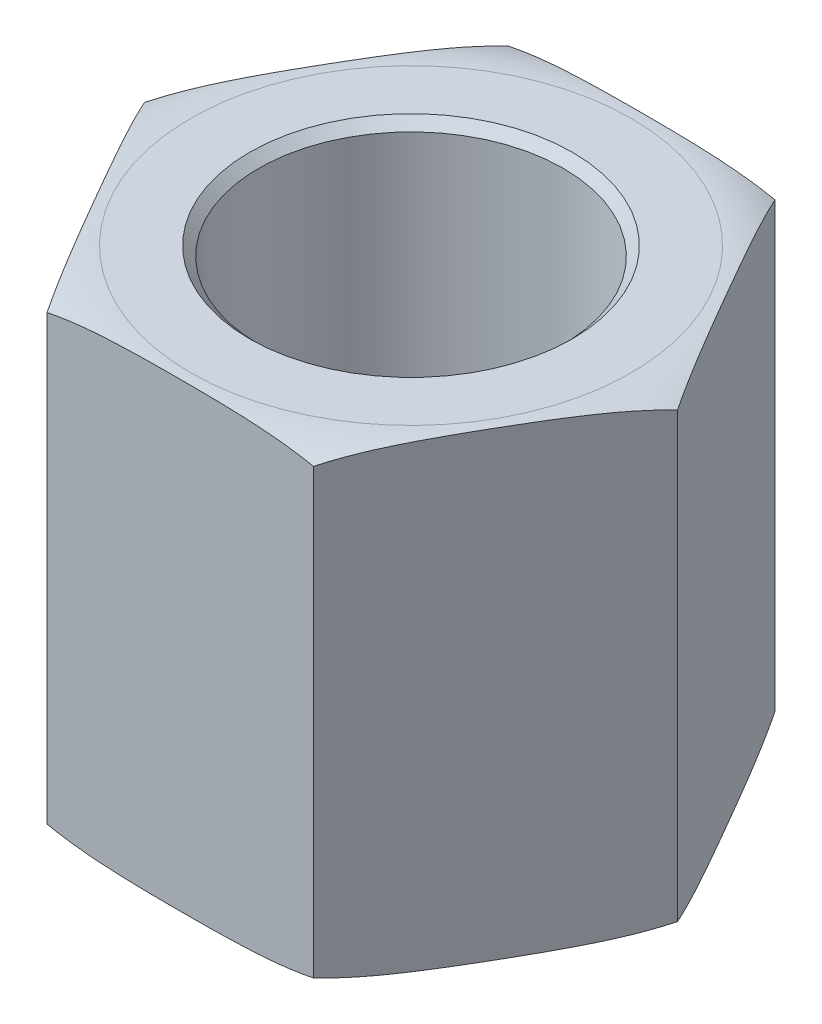
ISO-10303-21;
HEADER;
FILE_DESCRIPTION(('STEP AP214'),'2;1');
FILE_NAME('part.step','',(''),(''),'','','');
FILE_SCHEMA(('AUTOMOTIVE_DESIGN { 1 0 10303 214 1 1 1 1 }'));
ENDSEC;
DATA;
#1=APPLICATION_CONTEXT('core data for automotive mechanical design processes');
#2=APPLICATION_PROTOCOL_DEFINITION('international standard','automotive_design',2000,#1);
#3=PRODUCT_CONTEXT('',#1,'mechanical');
#4=PRODUCT('Part','Part','',(#3));
#5=PRODUCT_RELATED_PRODUCT_CATEGORY('part','',(#4));
#6=PRODUCT_DEFINITION_FORMATION('','',#4);
#7=PRODUCT_DEFINITION_CONTEXT('part definition',#1,'design');
#8=PRODUCT_DEFINITION('design','',#6,#7);
#9=PRODUCT_DEFINITION_SHAPE('','',#8);
#10=(LENGTH_UNIT() NAMED_UNIT(*) SI_UNIT(.MILLI.,.METRE.));
#11=(NAMED_UNIT(*) PLANE_ANGLE_UNIT() SI_UNIT($,.RADIAN.));
#12=(NAMED_UNIT(*) SI_UNIT($,.STERADIAN.) SOLID_ANGLE_UNIT());
#13=UNCERTAINTY_MEASURE_WITH_UNIT(LENGTH_MEASURE(1.E-05),#10,'distance_accuracy_value','');
#14=(GEOMETRIC_REPRESENTATION_CONTEXT(3) GLOBAL_UNCERTAINTY_ASSIGNED_CONTEXT((#13)) GLOBAL_UNIT_ASSIGNED_CONTEXT((#10,
#11,#12)) REPRESENTATION_CONTEXT('',''));
#15=CARTESIAN_POINT('',(0.,0.,0.));
#16=DIRECTION('',(0.,0.,1.));
#17=DIRECTION('',(1.,0.,0.));
#18=AXIS2_PLACEMENT_3D('',#15,#16,#17);
#19=CARTESIAN_POINT('',(3.66617420935412,3.175,0.));
#20=DIRECTION('',(-0.866025403784439,0.,0.5));
#21=DIRECTION('',(0.5,0.,0.866025403784439));
#22=AXIS2_PLACEMENT_3D('',#19,#20,#21);
#23=PLANE('',#22);
#24=DIRECTION('',(0.,1.,0.));
#25=VECTOR('',#24,1.);
#26=CARTESIAN_POINT('',(1.83308710467704,3.175,-3.175));
#27=LINE('',#26,#25);
#28=CARTESIAN_POINT('',(1.83308710467704,-3.048,-3.17500000000001));
#29=VERTEX_POINT('',#28);
#30=CARTESIAN_POINT('',(1.83308710467705,3.048,-3.175));
#31=VERTEX_POINT('',#30);
#32=EDGE_CURVE('E143',#29,#31,#27,.T.);
#33=ORIENTED_EDGE('',*,*,#32,.T.);
#34=CARTESIAN_POINT('',(3.66617420935412,3.048,0.));
#35=CARTESIAN_POINT('',(3.62797961467394,3.06390141489968,-0.0661549785605595));
#36=CARTESIAN_POINT('',(3.58956810864156,3.0774886076105,-0.132685658603879));
#37=CARTESIAN_POINT('',(3.5124905179571,3.10081619794021,-0.266187961794368));
#38=CARTESIAN_POINT('',(3.47382473049846,3.11056047713974,-0.333159070187402));
#39=CARTESIAN_POINT('',(3.39641631867872,3.1269966530451,-0.467234372392399));
#40=CARTESIAN_POINT('',(3.35767399633311,3.13369453286691,-0.534338043098205));
#41=CARTESIAN_POINT('',(3.28009834620112,3.1447767572932,-0.668703010557008));
#42=CARTESIAN_POINT('',(3.24126499587769,3.14916045047396,-0.735964346345298));
#43=CARTESIAN_POINT('',(3.16354065964313,3.15624030042628,-0.870586845688133));
#44=CARTESIAN_POINT('',(3.12464965374474,3.15893552375912,-0.937948043861607));
#45=CARTESIAN_POINT('',(3.0468514459459,3.16315319837134,-1.07269849250699));
#46=CARTESIAN_POINT('',(3.00794424351966,3.16467560802717,-1.1400877438896));
#47=CARTESIAN_POINT('',(2.9305151759887,3.16692270588903,-1.27419882283591));
#48=CARTESIAN_POINT('',(2.89199336248931,3.16765524681808,-1.34092056101655));
#49=CARTESIAN_POINT('',(2.8149477834614,3.16857673025741,-1.47436741839145));
#50=CARTESIAN_POINT('',(2.77642401791435,3.1687656658949,-1.54109253761781));
#51=CARTESIAN_POINT('',(2.69935964431008,3.16866599668056,-1.67457194815387));
#52=CARTESIAN_POINT('',(2.66081903631817,3.16837718117656,-1.74132623935046));
#53=CARTESIAN_POINT('',(2.58373908085325,3.167221986219,-1.87483263846085));
#54=CARTESIAN_POINT('',(2.5451997334124,3.16635559703857,-1.94158474631895));
#55=CARTESIAN_POINT('',(2.46812969629766,3.16378619406563,-2.07507396634291));
#56=CARTESIAN_POINT('',(2.4295990062596,3.16208322716165,-2.14181107913951));
#57=CARTESIAN_POINT('',(2.35255651340903,3.1574387229726,-2.27525259109846));
#58=CARTESIAN_POINT('',(2.31404470975437,3.1544972471358,-2.34195699171945));
#59=CARTESIAN_POINT('',(2.25084206239939,3.14821741247488,-2.45142718811113));
#60=CARTESIAN_POINT('',(2.22613849337005,3.14539801104631,-2.49421502479824));
#61=CARTESIAN_POINT('',(2.17676945272223,3.13886967943036,-2.57972471152119));
#62=CARTESIAN_POINT('',(2.15210397034179,3.1351610809139,-2.62244658019731));
#63=CARTESIAN_POINT('',(2.10282753811692,3.12668027114969,-2.7077958644265));
#64=CARTESIAN_POINT('',(2.07821657107525,3.12190846570084,-2.75042330976607));
#65=CARTESIAN_POINT('',(2.02900094683547,3.11109877125159,-2.8356672714756));
#66=CARTESIAN_POINT('',(2.00439646085461,3.10505773130842,-2.87828349128857));
#67=CARTESIAN_POINT('',(1.95527325900931,3.09151383541611,-2.96336737271508));
#68=CARTESIAN_POINT('',(1.93075459617612,3.08401019780296,-3.00583494247581));
#69=CARTESIAN_POINT('',(1.8818215737317,3.06732035070844,-3.09058942351746));
#70=CARTESIAN_POINT('',(1.85740744053269,3.05813149780328,-3.13287594264091));
#71=CARTESIAN_POINT('',(1.83308710467705,3.048,-3.175));
#72=B_SPLINE_CURVE_WITH_KNOTS('',3,(#34,#35,#36,#37,#38,#39,#40,#41,#42,#43,#44,#45,#46,#47,#48,
#49,#50,#51,#52,#53,#54,#55,#56,#57,#58,#59,#60,#61,#62,#63,#64,#65,#66,#67,#68,#69,#70,#71),
.UNSPECIFIED.,.F.,.F.,(4,2,2,2,2,2,2,2,2,2,2,2,2,2,2,2,2,2,4),(0.,0.23397730781795,
0.467717675040711,0.700996973557527,0.934341903229785,1.16781571967244,1.4012978217983,
1.63243665809676,1.86357841666624,2.09482211846302,2.32606971471504,2.55730435147407,
2.78852751694424,2.93698369265096,3.08538458004481,3.2337289233459,3.38244598546617,
3.53124274626086,3.68027493713586),.UNSPECIFIED.);
#73=CARTESIAN_POINT('',(3.66617420935412,3.048,0.));
#74=VERTEX_POINT('',#73);
#75=EDGE_CURVE('E97',#74,#31,#72,.T.);
#76=ORIENTED_EDGE('',*,*,#75,.F.);
#77=DIRECTION('',(0.,1.,0.));
#78=VECTOR('',#77,1.);
#79=CARTESIAN_POINT('',(3.66617420935412,3.175,0.));
#80=LINE('',#79,#78);
#81=CARTESIAN_POINT('',(3.66617420935412,-3.048,0.));
#82=VERTEX_POINT('',#81);
#83=EDGE_CURVE('E145',#74,#82,#80,.F.);
#84=ORIENTED_EDGE('',*,*,#83,.T.);
#85=CARTESIAN_POINT('',(1.83308710467705,-3.048,-3.17500000000001));
#86=CARTESIAN_POINT('',(1.87128169935723,-3.06390141489968,-3.10884502143945));
#87=CARTESIAN_POINT('',(1.9096932053896,-3.0774886076105,-3.04231434139613));
#88=CARTESIAN_POINT('',(1.98677079607407,-3.1008161979402,-2.90881203820564));
#89=CARTESIAN_POINT('',(2.02543658353271,-3.11056047713974,-2.84184092981261));
#90=CARTESIAN_POINT('',(2.10284499535245,-3.12699665304509,-2.70776562760762));
#91=CARTESIAN_POINT('',(2.14158731769805,-3.13369453286691,-2.64066195690181));
#92=CARTESIAN_POINT('',(2.21916296783005,-3.14477675729319,-2.50629698944301));
#93=CARTESIAN_POINT('',(2.25799631815347,-3.14916045047396,-2.43903565365472));
#94=CARTESIAN_POINT('',(2.33572065438803,-3.15624030042628,-2.30441315431189));
#95=CARTESIAN_POINT('',(2.37461166028642,-3.15893552375912,-2.23705195613842));
#96=CARTESIAN_POINT('',(2.45240986808526,-3.16315319837134,-2.10230150749304));
#97=CARTESIAN_POINT('',(2.49131707051149,-3.16467560802717,-2.03491225611043));
#98=CARTESIAN_POINT('',(2.56874613804246,-3.16692270588903,-1.90080117716412));
#99=CARTESIAN_POINT('',(2.60726795154184,-3.16765524681808,-1.83407943898349));
#100=CARTESIAN_POINT('',(2.68431353056976,-3.16857673025742,-1.70063258160858));
#101=CARTESIAN_POINT('',(2.7228372961168,-3.1687656658949,-1.63390746238223));
#102=CARTESIAN_POINT('',(2.79990166972107,-3.16866599668056,-1.50042805184616));
#103=CARTESIAN_POINT('',(2.83844227771298,-3.16837718117656,-1.43367376064958));
#104=CARTESIAN_POINT('',(2.9155222331779,-3.167221986219,-1.30016736153919));
#105=CARTESIAN_POINT('',(2.95406158061874,-3.16635559703857,-1.2334152536811));
#106=CARTESIAN_POINT('',(3.03113161773349,-3.16378619406563,-1.09992603365714));
#107=CARTESIAN_POINT('',(3.06966230777155,-3.16208322716165,-1.03318892086054));
#108=CARTESIAN_POINT('',(3.14670480062212,-3.15743872297261,-0.89974740890159));
#109=CARTESIAN_POINT('',(3.18521660427678,-3.1544972471358,-0.833043008280603));
#110=CARTESIAN_POINT('',(3.24841925163175,-3.14821741247488,-0.723572811888921));
#111=CARTESIAN_POINT('',(3.2731228206611,-3.14539801104632,-0.680784975201808));
#112=CARTESIAN_POINT('',(3.32249186130892,-3.13886967943036,-0.595275288478853));
#113=CARTESIAN_POINT('',(3.34715734368936,-3.1351610809139,-0.552553419802732));
#114=CARTESIAN_POINT('',(3.39643377591423,-3.12668027114969,-0.467204135573528));
#115=CARTESIAN_POINT('',(3.4210447429559,-3.12190846570084,-0.424576690233956));
#116=CARTESIAN_POINT('',(3.47026036719569,-3.11109877125159,-0.339332728524421));
#117=CARTESIAN_POINT('',(3.49486485317655,-3.10505773130842,-0.296716508711452));
#118=CARTESIAN_POINT('',(3.54398805502185,-3.09151383541612,-0.211632627284937));
#119=CARTESIAN_POINT('',(3.56850671785504,-3.08401019780296,-0.169165057524198));
#120=CARTESIAN_POINT('',(3.61743974029947,-3.06732035070844,-0.0844105764825437));
#121=CARTESIAN_POINT('',(3.64185387349848,-3.05813149780329,-0.0421240573590973));
#122=CARTESIAN_POINT('',(3.66617420935412,-3.048,0.));
#123=B_SPLINE_CURVE_WITH_KNOTS('',3,(#85,#86,#87,#88,#89,#90,#91,#92,#93,#94,#95,#96,#97,#98,
#99,#100,#101,#102,#103,#104,#105,#106,#107,#108,#109,#110,#111,#112,#113,#114,#115,#116,#117,
#118,#119,#120,#121,#122),.UNSPECIFIED.,.F.,.F.,(4,2,2,2,2,2,2,2,2,2,2,2,2,2,2,2,2,2,4),(0.,
0.233977307817946,0.467717675040702,0.700996973557513,0.934341903229767,1.16781571967242,
1.40129782179827,1.63243665809673,1.8635784166662,2.09482211846298,2.32606971471499,
2.55730435147402,2.78852751694418,2.93698369265092,3.08538458004477,3.23372892334588,
3.38244598546615,3.53124274626086,3.68027493713586),.UNSPECIFIED.);
#124=EDGE_CURVE('E221',#29,#82,#123,.T.);
#125=ORIENTED_EDGE('',*,*,#124,.F.);
#126=EDGE_LOOP('',(#33,#76,#84,#125));
#127=FACE_BOUND('',#126,.T.);
#128=ADVANCED_FACE('F17',(#127),#23,.F.);
#129=CARTESIAN_POINT('',(1.83308710467706,3.175,3.17499999999999));
#130=DIRECTION('',(-0.866025403784439,0.,-0.5));
#131=DIRECTION('',(-0.5,0.,0.866025403784439));
#132=AXIS2_PLACEMENT_3D('',#129,#130,#131);
#133=PLANE('',#132);
#134=ORIENTED_EDGE('',*,*,#83,.F.);
#135=CARTESIAN_POINT('',(1.83308710467706,3.048,3.17499999999999));
#136=CARTESIAN_POINT('',(1.87128169935724,3.06390141489968,3.10884502143943));
#137=CARTESIAN_POINT('',(1.90969320538962,3.0774886076105,3.04231434139611));
#138=CARTESIAN_POINT('',(1.98677079607408,3.10081619794021,2.90881203820562));
#139=CARTESIAN_POINT('',(2.02543658353273,3.11056047713974,2.84184092981259));
#140=CARTESIAN_POINT('',(2.10284499535246,3.1269966530451,2.70776562760759));
#141=CARTESIAN_POINT('',(2.14158731769807,3.13369453286691,2.64066195690179));
#142=CARTESIAN_POINT('',(2.21916296783006,3.1447767572932,2.50629698944298));
#143=CARTESIAN_POINT('',(2.25799631815349,3.14916045047396,2.43903565365469));
#144=CARTESIAN_POINT('',(2.33572065438805,3.15624030042628,2.30441315431186));
#145=CARTESIAN_POINT('',(2.37461166028644,3.15893552375912,2.23705195613839));
#146=CARTESIAN_POINT('',(2.45240986808528,3.16315319837134,2.102301507493));
#147=CARTESIAN_POINT('',(2.49131707051152,3.16467560802717,2.03491225611039));
#148=CARTESIAN_POINT('',(2.56874613804248,3.16692270588903,1.90080117716408));
#149=CARTESIAN_POINT('',(2.60726795154187,3.16765524681808,1.83407943898345));
#150=CARTESIAN_POINT('',(2.68431353056978,3.16857673025741,1.70063258160854));
#151=CARTESIAN_POINT('',(2.72283729611683,3.1687656658949,1.63390746238219));
#152=CARTESIAN_POINT('',(2.7999016697211,3.16866599668056,1.50042805184612));
#153=CARTESIAN_POINT('',(2.83844227771301,3.16837718117656,1.43367376064953));
#154=CARTESIAN_POINT('',(2.91552223317793,3.167221986219,1.30016736153914));
#155=CARTESIAN_POINT('',(2.95406158061878,3.16635559703857,1.23341525368105));
#156=CARTESIAN_POINT('',(3.03113161773353,3.16378619406563,1.09992603365708));
#157=CARTESIAN_POINT('',(3.06966230777158,3.16208322716165,1.03318892086048));
#158=CARTESIAN_POINT('',(3.14670480062215,3.1574387229726,0.899747408901533));
#159=CARTESIAN_POINT('',(3.18521660427681,3.1544972471358,0.833043008280545));
#160=CARTESIAN_POINT('',(3.24841925163179,3.14821741247488,0.723572811888865));
#161=CARTESIAN_POINT('',(3.27312282066113,3.14539801104631,0.680784975201756));
#162=CARTESIAN_POINT('',(3.32249186130895,3.13886967943036,0.595275288478808));
#163=CARTESIAN_POINT('',(3.34715734368939,3.1351610809139,0.55255341980269));
#164=CARTESIAN_POINT('',(3.39643377591426,3.12668027114969,0.467204135573494));
#165=CARTESIAN_POINT('',(3.42104474295592,3.12190846570084,0.424576690233925));
#166=CARTESIAN_POINT('',(3.47026036719571,3.11109877125159,0.339332728524397));
#167=CARTESIAN_POINT('',(3.49486485317657,3.10505773130842,0.296716508711432));
#168=CARTESIAN_POINT('',(3.54398805502186,3.09151383541612,0.211632627284924));
#169=CARTESIAN_POINT('',(3.56850671785505,3.08401019780296,0.169165057524189));
#170=CARTESIAN_POINT('',(3.61743974029947,3.06732035070844,0.0844105764825421));
#171=CARTESIAN_POINT('',(3.64185387349848,3.05813149780328,0.0421240573590994));
#172=CARTESIAN_POINT('',(3.66617420935412,3.048,0.));
#173=B_SPLINE_CURVE_WITH_KNOTS('',3,(#135,#136,#137,#138,#139,#140,#141,#142,#143,#144,#145,
#146,#147,#148,#149,#150,#151,#152,#153,#154,#155,#156,#157,#158,#159,#160,#161,#162,#163,#164,
#165,#166,#167,#168,#169,#170,#171,#172),.UNSPECIFIED.,.F.,.F.,(4,2,2,2,2,2,2,2,2,2,2,2,2,2,2,2,
2,2,4),(0.,0.23397730781795,0.467717675040712,0.700996973557526,0.934341903229785,
1.16781571967244,1.4012978217983,1.63243665809676,1.86357841666624,2.09482211846302,
2.32606971471504,2.55730435147407,2.78852751694424,2.93698369265096,3.0853845800448,
3.23372892334589,3.38244598546615,3.53124274626085,3.68027493713584),.UNSPECIFIED.);
#174=CARTESIAN_POINT('',(1.83308710467706,3.048,3.17499999999999));
#175=VERTEX_POINT('',#174);
#176=EDGE_CURVE('E214',#175,#74,#173,.T.);
#177=ORIENTED_EDGE('',*,*,#176,.F.);
#178=DIRECTION('',(0.,1.,0.));
#179=VECTOR('',#178,1.);
#180=CARTESIAN_POINT('',(1.83308710467706,3.175,3.17499999999999));
#181=LINE('',#180,#179);
#182=CARTESIAN_POINT('',(1.83308710467706,-3.048,3.17499999999999));
#183=VERTEX_POINT('',#182);
#184=EDGE_CURVE('E140',#175,#183,#181,.F.);
#185=ORIENTED_EDGE('',*,*,#184,.T.);
#186=CARTESIAN_POINT('',(3.66617420935412,-3.048,0.));
#187=CARTESIAN_POINT('',(3.62797961467394,-3.06390141489968,0.0661549785605642));
#188=CARTESIAN_POINT('',(3.58956810864156,-3.0774886076105,0.132685658603884));
#189=CARTESIAN_POINT('',(3.5124905179571,-3.10081619794021,0.266187961794373));
#190=CARTESIAN_POINT('',(3.47382473049845,-3.11056047713974,0.333159070187407));
#191=CARTESIAN_POINT('',(3.39641631867872,-3.1269966530451,0.467234372392404));
#192=CARTESIAN_POINT('',(3.35767399633311,-3.13369453286691,0.53433804309821));
#193=CARTESIAN_POINT('',(3.28009834620112,-3.1447767572932,0.668703010557013));
#194=CARTESIAN_POINT('',(3.24126499587769,-3.14916045047396,0.735964346345303));
#195=CARTESIAN_POINT('',(3.16354065964313,-3.15624030042628,0.870586845688138));
#196=CARTESIAN_POINT('',(3.12464965374474,-3.15893552375912,0.937948043861613));
#197=CARTESIAN_POINT('',(3.0468514459459,-3.16315319837134,1.07269849250699));
#198=CARTESIAN_POINT('',(3.00794424351966,-3.16467560802717,1.1400877438896));
#199=CARTESIAN_POINT('',(2.9305151759887,-3.16692270588903,1.27419882283592));
#200=CARTESIAN_POINT('',(2.89199336248931,-3.16765524681808,1.34092056101655));
#201=CARTESIAN_POINT('',(2.8149477834614,-3.16857673025741,1.47436741839146));
#202=CARTESIAN_POINT('',(2.77642401791435,-3.1687656658949,1.54109253761781));
#203=CARTESIAN_POINT('',(2.69935964431008,-3.16866599668056,1.67457194815388));
#204=CARTESIAN_POINT('',(2.66081903631817,-3.16837718117656,1.74132623935047));
#205=CARTESIAN_POINT('',(2.58373908085325,-3.167221986219,1.87483263846085));
#206=CARTESIAN_POINT('',(2.5451997334124,-3.16635559703857,1.94158474631895));
#207=CARTESIAN_POINT('',(2.46812969629765,-3.16378619406563,2.07507396634292));
#208=CARTESIAN_POINT('',(2.4295990062596,-3.16208322716165,2.14181107913952));
#209=CARTESIAN_POINT('',(2.35255651340903,-3.1574387229726,2.27525259109847));
#210=CARTESIAN_POINT('',(2.31404470975437,-3.1544972471358,2.34195699171945));
#211=CARTESIAN_POINT('',(2.25084206239939,-3.14821741247488,2.45142718811113));
#212=CARTESIAN_POINT('',(2.22613849337005,-3.14539801104631,2.49421502479824));
#213=CARTESIAN_POINT('',(2.17676945272223,-3.13886967943036,2.57972471152119));
#214=CARTESIAN_POINT('',(2.15210397034179,-3.1351610809139,2.62244658019731));
#215=CARTESIAN_POINT('',(2.10282753811692,-3.12668027114969,2.7077958644265));
#216=CARTESIAN_POINT('',(2.07821657107526,-3.12190846570084,2.75042330976607));
#217=CARTESIAN_POINT('',(2.02900094683547,-3.11109877125159,2.8356672714756));
#218=CARTESIAN_POINT('',(2.00439646085461,-3.10505773130842,2.87828349128856));
#219=CARTESIAN_POINT('',(1.95527325900932,-3.09151383541611,2.96336737271507));
#220=CARTESIAN_POINT('',(1.93075459617613,-3.08401019780296,3.00583494247581));
#221=CARTESIAN_POINT('',(1.88182157373171,-3.06732035070844,3.09058942351745));
#222=CARTESIAN_POINT('',(1.8574074405327,-3.05813149780328,3.1328759426409));
#223=CARTESIAN_POINT('',(1.83308710467706,-3.048,3.17499999999999));
#224=B_SPLINE_CURVE_WITH_KNOTS('',3,(#186,#187,#188,#189,#190,#191,#192,#193,#194,#195,#196,
#197,#198,#199,#200,#201,#202,#203,#204,#205,#206,#207,#208,#209,#210,#211,#212,#213,#214,#215,
#216,#217,#218,#219,#220,#221,#222,#223),.UNSPECIFIED.,.F.,.F.,(4,2,2,2,2,2,2,2,2,2,2,2,2,2,2,2,
2,2,4),(0.,0.23397730781795,0.467717675040712,0.700996973557527,0.934341903229786,
1.16781571967244,1.4012978217983,1.63243665809676,1.86357841666624,2.09482211846302,
2.32606971471504,2.55730435147408,2.78852751694424,2.93698369265096,3.0853845800448,
3.23372892334589,3.38244598546615,3.53124274626085,3.68027493713584),.UNSPECIFIED.);
#225=EDGE_CURVE('E240',#82,#183,#224,.T.);
#226=ORIENTED_EDGE('',*,*,#225,.F.);
#227=EDGE_LOOP('',(#134,#177,#185,#226));
#228=FACE_BOUND('',#227,.T.);
#229=ADVANCED_FACE('F218',(#228),#133,.F.);
#230=CARTESIAN_POINT('',(1.83308710467706,3.175,-3.175));
#231=DIRECTION('',(0.,0.,1.));
#232=DIRECTION('',(1.,0.,0.));
#233=AXIS2_PLACEMENT_3D('',#230,#231,#232);
#234=PLANE('',#233);
#235=DIRECTION('',(0.,1.,0.));
#236=VECTOR('',#235,1.);
#237=CARTESIAN_POINT('',(-1.83308710467707,3.175,-3.175));
#238=LINE('',#237,#236);
#239=CARTESIAN_POINT('',(-1.83308710467707,-3.048,-3.175));
#240=VERTEX_POINT('',#239);
#241=CARTESIAN_POINT('',(-1.83308710467706,3.048,-3.17500000000001));
#242=VERTEX_POINT('',#241);
#243=EDGE_CURVE('E104',#240,#242,#238,.T.);
#244=ORIENTED_EDGE('',*,*,#243,.T.);
#245=CARTESIAN_POINT('',(1.83308710467706,3.048,-3.17500000000001));
#246=CARTESIAN_POINT('',(1.73237579828683,3.06894001415179,-3.175));
#247=CARTESIAN_POINT('',(1.63096506893486,3.08588534953273,-3.175));
#248=CARTESIAN_POINT('',(1.42767146651469,3.11349716439842,-3.175));
#249=CARTESIAN_POINT('',(1.32579191427254,3.12418756587531,-3.175));
#250=CARTESIAN_POINT('',(1.12177634709137,3.14112804080793,-3.175));
#251=CARTESIAN_POINT('',(1.01964056643379,3.14738127071887,-3.175));
#252=CARTESIAN_POINT('',(0.815663681397375,3.15690280641833,-3.175));
#253=CARTESIAN_POINT('',(0.713823115514572,3.1601834044999,-3.175));
#254=CARTESIAN_POINT('',(0.510018485441651,3.16494548487028,-3.175));
#255=CARTESIAN_POINT('',(0.408054390577976,3.16642541008817,-3.175));
#256=CARTESIAN_POINT('',(0.20406020033787,3.16831468183792,-3.175));
#257=CARTESIAN_POINT('',(0.102030100168935,3.16872342414921,-3.175));
#258=CARTESIAN_POINT('',(-0.102030100168934,3.16872342414921,-3.175));
#259=CARTESIAN_POINT('',(-0.204060200337869,3.16831468183792,-3.175));
#260=CARTESIAN_POINT('',(-0.408054390577974,3.16642541008817,-3.175));
#261=CARTESIAN_POINT('',(-0.510018485441649,3.16494548487028,-3.175));
#262=CARTESIAN_POINT('',(-0.71382311551457,3.1601834044999,-3.175));
#263=CARTESIAN_POINT('',(-0.815663681397372,3.15690280641833,-3.175));
#264=CARTESIAN_POINT('',(-1.01964056643379,3.14738127071887,-3.175));
#265=CARTESIAN_POINT('',(-1.12177634709137,3.14112804080793,-3.175));
#266=CARTESIAN_POINT('',(-1.32579191427253,3.12418756587531,-3.175));
#267=CARTESIAN_POINT('',(-1.42767146651468,3.11349716439842,-3.175));
#268=CARTESIAN_POINT('',(-1.63096506893485,3.08588534953273,-3.175));
#269=CARTESIAN_POINT('',(-1.73237579828682,3.06894001415179,-3.175));
#270=CARTESIAN_POINT('',(-1.83308710467705,3.048,-3.175));
#271=B_SPLINE_CURVE_WITH_KNOTS('',3,(#245,#246,#247,#248,#249,#250,#251,#252,#253,#254,#255,
#256,#257,#258,#259,#260,#261,#262,#263,#264,#265,#266,#267,#268,#269,#270),.UNSPECIFIED.,.F.,
.F.,(4,2,2,2,2,2,2,2,2,2,2,2,4),(0.,0.308333242342807,0.615479423308234,0.922406891130007,
1.2280592962085,1.53397581645216,1.84006485747888,2.14615389850561,2.45207041874927,
2.75772282382776,3.06465029164953,3.37179647261496,3.68012971495776),.UNSPECIFIED.);
#272=EDGE_CURVE('E89',#31,#242,#271,.T.);
#273=ORIENTED_EDGE('',*,*,#272,.F.);
#274=ORIENTED_EDGE('',*,*,#32,.F.);
#275=CARTESIAN_POINT('',(-1.83308710467707,-3.048,-3.175));
#276=CARTESIAN_POINT('',(-1.73237579828684,-3.06894001415179,-3.175));
#277=CARTESIAN_POINT('',(-1.63096506893487,-3.08588534953273,-3.175));
#278=CARTESIAN_POINT('',(-1.4276714665147,-3.11349716439842,-3.175));
#279=CARTESIAN_POINT('',(-1.32579191427255,-3.12418756587531,-3.175));
#280=CARTESIAN_POINT('',(-1.12177634709138,-3.14112804080793,-3.175));
#281=CARTESIAN_POINT('',(-1.0196405664338,-3.14738127071887,-3.175));
#282=CARTESIAN_POINT('',(-0.81566368139738,-3.15690280641833,-3.175));
#283=CARTESIAN_POINT('',(-0.713823115514576,-3.1601834044999,-3.175));
#284=CARTESIAN_POINT('',(-0.510018485441653,-3.16494548487028,-3.175));
#285=CARTESIAN_POINT('',(-0.408054390577979,-3.16642541008817,-3.175));
#286=CARTESIAN_POINT('',(-0.204060200337872,-3.16831468183792,-3.175));
#287=CARTESIAN_POINT('',(-0.102030100168936,-3.16872342414921,-3.175));
#288=CARTESIAN_POINT('',(0.102030100168934,-3.16872342414921,-3.175));
#289=CARTESIAN_POINT('',(0.204060200337869,-3.16831468183792,-3.175));
#290=CARTESIAN_POINT('',(0.408054390577973,-3.16642541008817,-3.175));
#291=CARTESIAN_POINT('',(0.510018485441647,-3.16494548487028,-3.175));
#292=CARTESIAN_POINT('',(0.713823115514568,-3.1601834044999,-3.175));
#293=CARTESIAN_POINT('',(0.81566368139737,-3.15690280641833,-3.175));
#294=CARTESIAN_POINT('',(1.01964056643379,-3.14738127071887,-3.175));
#295=CARTESIAN_POINT('',(1.12177634709137,-3.14112804080793,-3.175));
#296=CARTESIAN_POINT('',(1.32579191427253,-3.12418756587531,-3.175));
#297=CARTESIAN_POINT('',(1.42767146651468,-3.11349716439842,-3.175));
#298=CARTESIAN_POINT('',(1.63096506893485,-3.08588534953273,-3.175));
#299=CARTESIAN_POINT('',(1.73237579828682,-3.06894001415179,-3.175));
#300=CARTESIAN_POINT('',(1.83308710467704,-3.048,-3.17500000000001));
#301=B_SPLINE_CURVE_WITH_KNOTS('',3,(#275,#276,#277,#278,#279,#280,#281,#282,#283,#284,#285,
#286,#287,#288,#289,#290,#291,#292,#293,#294,#295,#296,#297,#298,#299,#300),.UNSPECIFIED.,.F.,
.F.,(4,2,2,2,2,2,2,2,2,2,2,2,4),(0.,0.308333242342809,0.615479423308238,0.922406891130013,
1.22805929620851,1.53397581645217,1.8400648574789,2.14615389850562,2.45207041874928,
2.75772282382777,3.06465029164954,3.37179647261496,3.68012971495777),.UNSPECIFIED.);
#302=EDGE_CURVE('E106',#240,#29,#301,.T.);
#303=ORIENTED_EDGE('',*,*,#302,.F.);
#304=EDGE_LOOP('',(#244,#273,#274,#303));
#305=FACE_BOUND('',#304,.T.);
#306=ADVANCED_FACE('F105',(#305),#234,.F.);
#307=CARTESIAN_POINT('',(-1.83308710467707,3.175,3.175));
#308=DIRECTION('',(0.,0.,-1.));
#309=DIRECTION('',(-1.,0.,0.));
#310=AXIS2_PLACEMENT_3D('',#307,#308,#309);
#311=PLANE('',#310);
#312=ORIENTED_EDGE('',*,*,#184,.F.);
#313=CARTESIAN_POINT('',(-1.83308710467706,3.048,3.175));
#314=CARTESIAN_POINT('',(-1.73237579828684,3.06894001415179,3.175));
#315=CARTESIAN_POINT('',(-1.63096506893486,3.08588534953273,3.175));
#316=CARTESIAN_POINT('',(-1.42767146651469,3.11349716439842,3.175));
#317=CARTESIAN_POINT('',(-1.32579191427254,3.12418756587531,3.175));
#318=CARTESIAN_POINT('',(-1.12177634709138,3.14112804080793,3.175));
#319=CARTESIAN_POINT('',(-1.0196405664338,3.14738127071887,3.175));
#320=CARTESIAN_POINT('',(-0.815663681397378,3.15690280641833,3.175));
#321=CARTESIAN_POINT('',(-0.713823115514575,3.1601834044999,3.175));
#322=CARTESIAN_POINT('',(-0.510018485441652,3.16494548487028,3.175));
#323=CARTESIAN_POINT('',(-0.408054390577977,3.16642541008817,3.175));
#324=CARTESIAN_POINT('',(-0.204060200337871,3.16831468183792,3.175));
#325=CARTESIAN_POINT('',(-0.102030100168935,3.16872342414921,3.175));
#326=CARTESIAN_POINT('',(0.102030100168935,3.16872342414921,3.175));
#327=CARTESIAN_POINT('',(0.204060200337871,3.16831468183792,3.17499999999999));
#328=CARTESIAN_POINT('',(0.408054390577978,3.16642541008817,3.17499999999999));
#329=CARTESIAN_POINT('',(0.510018485441653,3.16494548487028,3.17499999999999));
#330=CARTESIAN_POINT('',(0.713823115514575,3.1601834044999,3.17499999999999));
#331=CARTESIAN_POINT('',(0.815663681397378,3.15690280641833,3.17499999999999));
#332=CARTESIAN_POINT('',(1.0196405664338,3.14738127071887,3.17499999999999));
#333=CARTESIAN_POINT('',(1.12177634709138,3.14112804080793,3.17499999999999));
#334=CARTESIAN_POINT('',(1.32579191427254,3.12418756587531,3.17499999999999));
#335=CARTESIAN_POINT('',(1.4276714665147,3.11349716439842,3.17499999999999));
#336=CARTESIAN_POINT('',(1.63096506893486,3.08588534953273,3.17499999999999));
#337=CARTESIAN_POINT('',(1.73237579828684,3.06894001415179,3.17499999999999));
#338=CARTESIAN_POINT('',(1.83308710467706,3.048,3.17499999999999));
#339=B_SPLINE_CURVE_WITH_KNOTS('',3,(#313,#314,#315,#316,#317,#318,#319,#320,#321,#322,#323,
#324,#325,#326,#327,#328,#329,#330,#331,#332,#333,#334,#335,#336,#337,#338),.UNSPECIFIED.,.F.,
.F.,(4,2,2,2,2,2,2,2,2,2,2,2,4),(0.,0.308333242342808,0.615479423308236,0.922406891130011,
1.2280592962085,1.53397581645216,1.84006485747889,2.14615389850562,2.45207041874928,
2.75772282382777,3.06465029164955,3.37179647261498,3.68012971495778),.UNSPECIFIED.);
#340=CARTESIAN_POINT('',(-1.83308710467707,3.048,3.175));
#341=VERTEX_POINT('',#340);
#342=EDGE_CURVE('E100',#341,#175,#339,.T.);
#343=ORIENTED_EDGE('',*,*,#342,.F.);
#344=DIRECTION('',(0.,1.,0.));
#345=VECTOR('',#344,1.);
#346=CARTESIAN_POINT('',(-1.83308710467707,3.175,3.175));
#347=LINE('',#346,#345);
#348=CARTESIAN_POINT('',(-1.83308710467706,-3.048,3.175));
#349=VERTEX_POINT('',#348);
#350=EDGE_CURVE('E108',#341,#349,#347,.F.);
#351=ORIENTED_EDGE('',*,*,#350,.T.);
#352=CARTESIAN_POINT('',(1.83308710467706,-3.048,3.17499999999999));
#353=CARTESIAN_POINT('',(1.73237579828684,-3.06894001415179,3.17499999999999));
#354=CARTESIAN_POINT('',(1.63096506893486,-3.08588534953273,3.17499999999999));
#355=CARTESIAN_POINT('',(1.4276714665147,-3.11349716439842,3.17499999999999));
#356=CARTESIAN_POINT('',(1.32579191427254,-3.12418756587531,3.17499999999999));
#357=CARTESIAN_POINT('',(1.12177634709138,-3.14112804080793,3.17499999999999));
#358=CARTESIAN_POINT('',(1.0196405664338,-3.14738127071887,3.17499999999999));
#359=CARTESIAN_POINT('',(0.815663681397379,-3.15690280641833,3.17499999999999));
#360=CARTESIAN_POINT('',(0.713823115514576,-3.1601834044999,3.17499999999999));
#361=CARTESIAN_POINT('',(0.510018485441653,-3.16494548487028,3.17499999999999));
#362=CARTESIAN_POINT('',(0.408054390577978,-3.16642541008817,3.17499999999999));
#363=CARTESIAN_POINT('',(0.204060200337871,-3.16831468183792,3.17499999999999));
#364=CARTESIAN_POINT('',(0.102030100168935,-3.16872342414921,3.175));
#365=CARTESIAN_POINT('',(-0.102030100168935,-3.16872342414921,3.175));
#366=CARTESIAN_POINT('',(-0.204060200337871,-3.16831468183792,3.175));
#367=CARTESIAN_POINT('',(-0.408054390577977,-3.16642541008817,3.175));
#368=CARTESIAN_POINT('',(-0.510018485441652,-3.16494548487028,3.175));
#369=CARTESIAN_POINT('',(-0.713823115514574,-3.1601834044999,3.175));
#370=CARTESIAN_POINT('',(-0.815663681397377,-3.15690280641833,3.175));
#371=CARTESIAN_POINT('',(-1.0196405664338,-3.14738127071887,3.175));
#372=CARTESIAN_POINT('',(-1.12177634709138,-3.14112804080793,3.175));
#373=CARTESIAN_POINT('',(-1.32579191427254,-3.12418756587531,3.175));
#374=CARTESIAN_POINT('',(-1.42767146651469,-3.11349716439842,3.175));
#375=CARTESIAN_POINT('',(-1.63096506893486,-3.08588534953273,3.175));
#376=CARTESIAN_POINT('',(-1.73237579828683,-3.06894001415179,3.175));
#377=CARTESIAN_POINT('',(-1.83308710467706,-3.048,3.175));
#378=B_SPLINE_CURVE_WITH_KNOTS('',3,(#352,#353,#354,#355,#356,#357,#358,#359,#360,#361,#362,
#363,#364,#365,#366,#367,#368,#369,#370,#371,#372,#373,#374,#375,#376,#377),.UNSPECIFIED.,.F.,
.F.,(4,2,2,2,2,2,2,2,2,2,2,2,4),(0.,0.308333242342808,0.615479423308237,0.922406891130012,
1.22805929620851,1.53397581645217,1.84006485747889,2.14615389850562,2.45207041874928,
2.75772282382777,3.06465029164955,3.37179647261498,3.68012971495778),.UNSPECIFIED.);
#379=EDGE_CURVE('E208',#183,#349,#378,.T.);
#380=ORIENTED_EDGE('',*,*,#379,.F.);
#381=EDGE_LOOP('',(#312,#343,#351,#380));
#382=FACE_BOUND('',#381,.T.);
#383=ADVANCED_FACE('F369',(#382),#311,.F.);
#384=CARTESIAN_POINT('',(-3.66617420935413,3.175,0.));
#385=DIRECTION('',(0.866025403784439,0.,-0.499999999999999));
#386=DIRECTION('',(-0.499999999999999,0.,-0.866025403784439));
#387=AXIS2_PLACEMENT_3D('',#384,#385,#386);
#388=PLANE('',#387);
#389=ORIENTED_EDGE('',*,*,#350,.F.);
#390=CARTESIAN_POINT('',(-3.66617420935412,3.048,0.));
#391=CARTESIAN_POINT('',(-3.62797961467395,3.06390141489968,0.0661549785605639));
#392=CARTESIAN_POINT('',(-3.58956810864157,3.0774886076105,0.132685658603883));
#393=CARTESIAN_POINT('',(-3.51249051795711,3.10081619794021,0.266187961794372));
#394=CARTESIAN_POINT('',(-3.47382473049846,3.11056047713974,0.333159070187406));
#395=CARTESIAN_POINT('',(-3.39641631867873,3.12699665304509,0.467234372392402));
#396=CARTESIAN_POINT('',(-3.35767399633312,3.13369453286691,0.534338043098208));
#397=CARTESIAN_POINT('',(-3.28009834620112,3.14477675729319,0.66870301055701));
#398=CARTESIAN_POINT('',(-3.2412649958777,3.14916045047396,0.7359643463453));
#399=CARTESIAN_POINT('',(-3.16354065964313,3.15624030042628,0.870586845688136));
#400=CARTESIAN_POINT('',(-3.12464965374474,3.15893552375912,0.937948043861609));
#401=CARTESIAN_POINT('',(-3.04685144594591,3.16315319837134,1.07269849250699));
#402=CARTESIAN_POINT('',(-3.00794424351967,3.16467560802717,1.1400877438896));
#403=CARTESIAN_POINT('',(-2.93051517598871,3.16692270588903,1.27419882283591));
#404=CARTESIAN_POINT('',(-2.89199336248932,3.16765524681808,1.34092056101655));
#405=CARTESIAN_POINT('',(-2.81494778346141,3.16857673025741,1.47436741839145));
#406=CARTESIAN_POINT('',(-2.77642401791436,3.1687656658949,1.54109253761781));
#407=CARTESIAN_POINT('',(-2.69935964431009,3.16866599668056,1.67457194815387));
#408=CARTESIAN_POINT('',(-2.66081903631818,3.16837718117655,1.74132623935046));
#409=CARTESIAN_POINT('',(-2.58373908085326,3.16722198621899,1.87483263846085));
#410=CARTESIAN_POINT('',(-2.54519973341241,3.16635559703857,1.94158474631894));
#411=CARTESIAN_POINT('',(-2.46812969629766,3.16378619406563,2.07507396634291));
#412=CARTESIAN_POINT('',(-2.42959900625961,3.16208322716165,2.14181107913951));
#413=CARTESIAN_POINT('',(-2.35255651340904,3.1574387229726,2.27525259109846));
#414=CARTESIAN_POINT('',(-2.31404470975438,3.1544972471358,2.34195699171945));
#415=CARTESIAN_POINT('',(-2.2508420623994,3.14821741247488,2.45142718811113));
#416=CARTESIAN_POINT('',(-2.22613849337006,3.14539801104631,2.49421502479824));
#417=CARTESIAN_POINT('',(-2.17676945272224,3.13886967943036,2.57972471152119));
#418=CARTESIAN_POINT('',(-2.1521039703418,3.1351610809139,2.62244658019731));
#419=CARTESIAN_POINT('',(-2.10282753811693,3.12668027114968,2.7077958644265));
#420=CARTESIAN_POINT('',(-2.07821657107527,3.12190846570084,2.75042330976607));
#421=CARTESIAN_POINT('',(-2.02900094683548,3.11109877125159,2.8356672714756));
#422=CARTESIAN_POINT('',(-2.00439646085462,3.10505773130841,2.87828349128857));
#423=CARTESIAN_POINT('',(-1.95527325900933,3.09151383541611,2.96336737271508));
#424=CARTESIAN_POINT('',(-1.93075459617614,3.08401019780296,3.00583494247581));
#425=CARTESIAN_POINT('',(-1.88182157373171,3.06732035070844,3.09058942351746));
#426=CARTESIAN_POINT('',(-1.8574074405327,3.05813149780328,3.1328759426409));
#427=CARTESIAN_POINT('',(-1.83308710467707,3.048,3.175));
#428=B_SPLINE_CURVE_WITH_KNOTS('',3,(#390,#391,#392,#393,#394,#395,#396,#397,#398,#399,#400,
#401,#402,#403,#404,#405,#406,#407,#408,#409,#410,#411,#412,#413,#414,#415,#416,#417,#418,#419,
#420,#421,#422,#423,#424,#425,#426,#427),.UNSPECIFIED.,.F.,.F.,(4,2,2,2,2,2,2,2,2,2,2,2,2,2,2,2,
2,2,4),(0.,0.23397730781795,0.46771767504071,0.700996973557524,0.934341903229782,
1.16781571967244,1.40129782179829,1.63243665809675,1.86357841666623,2.09482211846301,
2.32606971471503,2.55730435147407,2.78852751694423,2.93698369265095,3.0853845800448,
3.23372892334589,3.38244598546615,3.53124274626085,3.68027493713584),.UNSPECIFIED.);
#429=CARTESIAN_POINT('',(-3.66617420935413,3.048,0.));
#430=VERTEX_POINT('',#429);
#431=EDGE_CURVE('E101',#430,#341,#428,.T.);
#432=ORIENTED_EDGE('',*,*,#431,.F.);
#433=DIRECTION('',(0.,1.,0.));
#434=VECTOR('',#433,1.);
#435=CARTESIAN_POINT('',(-3.66617420935413,3.175,0.));
#436=LINE('',#435,#434);
#437=CARTESIAN_POINT('',(-3.66617420935412,-3.048,0.));
#438=VERTEX_POINT('',#437);
#439=EDGE_CURVE('E83',#430,#438,#436,.F.);
#440=ORIENTED_EDGE('',*,*,#439,.T.);
#441=CARTESIAN_POINT('',(-1.83308710467707,-3.048,3.175));
#442=CARTESIAN_POINT('',(-1.87128169935724,-3.06390141489968,3.10884502143944));
#443=CARTESIAN_POINT('',(-1.90969320538962,-3.0774886076105,3.04231434139612));
#444=CARTESIAN_POINT('',(-1.98677079607408,-3.1008161979402,2.90881203820564));
#445=CARTESIAN_POINT('',(-2.02543658353273,-3.11056047713974,2.8418409298126));
#446=CARTESIAN_POINT('',(-2.10284499535246,-3.12699665304509,2.70776562760761));
#447=CARTESIAN_POINT('',(-2.14158731769807,-3.13369453286691,2.6406619569018));
#448=CARTESIAN_POINT('',(-2.21916296783006,-3.14477675729319,2.506296989443));
#449=CARTESIAN_POINT('',(-2.25799631815348,-3.14916045047396,2.43903565365471));
#450=CARTESIAN_POINT('',(-2.33572065438805,-3.15624030042628,2.30441315431188));
#451=CARTESIAN_POINT('',(-2.37461166028644,-3.15893552375912,2.23705195613841));
#452=CARTESIAN_POINT('',(-2.45240986808527,-3.16315319837134,2.10230150749303));
#453=CARTESIAN_POINT('',(-2.49131707051151,-3.16467560802717,2.03491225611042));
#454=CARTESIAN_POINT('',(-2.56874613804247,-3.16692270588903,1.90080117716411));
#455=CARTESIAN_POINT('',(-2.60726795154186,-3.16765524681808,1.83407943898347));
#456=CARTESIAN_POINT('',(-2.68431353056977,-3.16857673025741,1.70063258160857));
#457=CARTESIAN_POINT('',(-2.72283729611682,-3.1687656658949,1.63390746238222));
#458=CARTESIAN_POINT('',(-2.79990166972109,-3.16866599668056,1.50042805184615));
#459=CARTESIAN_POINT('',(-2.838442277713,-3.16837718117656,1.43367376064957));
#460=CARTESIAN_POINT('',(-2.91552223317792,-3.167221986219,1.30016736153918));
#461=CARTESIAN_POINT('',(-2.95406158061876,-3.16635559703857,1.23341525368108));
#462=CARTESIAN_POINT('',(-3.03113161773351,-3.16378619406563,1.09992603365712));
#463=CARTESIAN_POINT('',(-3.06966230777156,-3.16208322716165,1.03318892086052));
#464=CARTESIAN_POINT('',(-3.14670480062213,-3.1574387229726,0.899747408901574));
#465=CARTESIAN_POINT('',(-3.18521660427679,-3.1544972471358,0.833043008280588));
#466=CARTESIAN_POINT('',(-3.24841925163177,-3.14821741247488,0.723572811888906));
#467=CARTESIAN_POINT('',(-3.27312282066112,-3.14539801104632,0.680784975201794));
#468=CARTESIAN_POINT('',(-3.32249186130893,-3.13886967943036,0.595275288478842));
#469=CARTESIAN_POINT('',(-3.34715734368937,-3.1351610809139,0.552553419802721));
#470=CARTESIAN_POINT('',(-3.39643377591425,-3.12668027114969,0.46720413557352));
#471=CARTESIAN_POINT('',(-3.42104474295591,-3.12190846570084,0.424576690233949));
#472=CARTESIAN_POINT('',(-3.4702603671957,-3.11109877125159,0.339332728524416));
#473=CARTESIAN_POINT('',(-3.49486485317656,-3.10505773130842,0.296716508711449));
#474=CARTESIAN_POINT('',(-3.54398805502186,-3.09151383541612,0.211632627284936));
#475=CARTESIAN_POINT('',(-3.56850671785505,-3.08401019780296,0.169165057524198));
#476=CARTESIAN_POINT('',(-3.61743974029947,-3.06732035070844,0.0844105764825466));
#477=CARTESIAN_POINT('',(-3.64185387349849,-3.05813149780328,0.0421240573591017));
#478=CARTESIAN_POINT('',(-3.66617420935412,-3.048,0.));
#479=B_SPLINE_CURVE_WITH_KNOTS('',3,(#441,#442,#443,#444,#445,#446,#447,#448,#449,#450,#451,
#452,#453,#454,#455,#456,#457,#458,#459,#460,#461,#462,#463,#464,#465,#466,#467,#468,#469,#470,
#471,#472,#473,#474,#475,#476,#477,#478),.UNSPECIFIED.,.F.,.F.,(4,2,2,2,2,2,2,2,2,2,2,2,2,2,2,2,
2,2,4),(0.,0.233977307817947,0.467717675040704,0.700996973557516,0.934341903229771,
1.16781571967242,1.40129782179828,1.63243665809673,1.86357841666621,2.09482211846299,
2.326069714715,2.55730435147403,2.78852751694419,2.93698369265092,3.08538458004478,
3.23372892334588,3.38244598546614,3.53124274626085,3.68027493713585),.UNSPECIFIED.);
#480=EDGE_CURVE('E162',#349,#438,#479,.T.);
#481=ORIENTED_EDGE('',*,*,#480,.F.);
#482=EDGE_LOOP('',(#389,#432,#440,#481));
#483=FACE_BOUND('',#482,.T.);
#484=ADVANCED_FACE('F211',(#483),#388,.F.);
#485=CARTESIAN_POINT('',(-1.83308710467707,3.175,-3.175));
#486=DIRECTION('',(0.866025403784439,0.,0.5));
#487=DIRECTION('',(0.5,0.,-0.866025403784439));
#488=AXIS2_PLACEMENT_3D('',#485,#486,#487);
#489=PLANE('',#488);
#490=ORIENTED_EDGE('',*,*,#439,.F.);
#491=CARTESIAN_POINT('',(-1.83308710467706,3.04799999999999,-3.17500000000001));
#492=CARTESIAN_POINT('',(-1.87128169935723,3.06390141489968,-3.10884502143945));
#493=CARTESIAN_POINT('',(-1.90969320538961,3.07748860761049,-3.04231434139614));
#494=CARTESIAN_POINT('',(-1.98677079607407,3.1008161979402,-2.90881203820565));
#495=CARTESIAN_POINT('',(-2.02543658353272,3.11056047713973,-2.84184092981262));
#496=CARTESIAN_POINT('',(-2.10284499535245,3.12699665304509,-2.70776562760763));
#497=CARTESIAN_POINT('',(-2.14158731769806,3.13369453286691,-2.64066195690182));
#498=CARTESIAN_POINT('',(-2.21916296783005,3.14477675729319,-2.50629698944302));
#499=CARTESIAN_POINT('',(-2.25799631815347,3.14916045047396,-2.43903565365474));
#500=CARTESIAN_POINT('',(-2.33572065438804,3.15624030042628,-2.3044131543119));
#501=CARTESIAN_POINT('',(-2.37461166028643,3.15893552375911,-2.23705195613843));
#502=CARTESIAN_POINT('',(-2.45240986808526,3.16315319837134,-2.10230150749305));
#503=CARTESIAN_POINT('',(-2.4913170705115,3.16467560802717,-2.03491225611045));
#504=CARTESIAN_POINT('',(-2.56874613804246,3.16692270588903,-1.90080117716414));
#505=CARTESIAN_POINT('',(-2.60726795154185,3.16765524681808,-1.83407943898351));
#506=CARTESIAN_POINT('',(-2.68431353056976,3.16857673025741,-1.7006325816086));
#507=CARTESIAN_POINT('',(-2.7228372961168,3.1687656658949,-1.63390746238225));
#508=CARTESIAN_POINT('',(-2.79990166972107,3.16866599668056,-1.50042805184619));
#509=CARTESIAN_POINT('',(-2.83844227771298,3.16837718117656,-1.4336737606496));
#510=CARTESIAN_POINT('',(-2.9155222331779,3.167221986219,-1.30016736153922));
#511=CARTESIAN_POINT('',(-2.95406158061874,3.16635559703857,-1.23341525368112));
#512=CARTESIAN_POINT('',(-3.03113161773349,3.16378619406563,-1.09992603365716));
#513=CARTESIAN_POINT('',(-3.06966230777155,3.16208322716165,-1.03318892086056));
#514=CARTESIAN_POINT('',(-3.14670480062211,3.1574387229726,-0.899747408901617));
#515=CARTESIAN_POINT('',(-3.18521660427677,3.1544972471358,-0.83304300828063));
#516=CARTESIAN_POINT('',(-3.24841925163175,3.14821741247488,-0.723572811888947));
#517=CARTESIAN_POINT('',(-3.2731228206611,3.14539801104632,-0.680784975201834));
#518=CARTESIAN_POINT('',(-3.32249186130892,3.13886967943036,-0.595275288478877));
#519=CARTESIAN_POINT('',(-3.34715734368936,3.1351610809139,-0.552553419802754));
#520=CARTESIAN_POINT('',(-3.39643377591424,3.12668027114969,-0.467204135573547));
#521=CARTESIAN_POINT('',(-3.4210447429559,3.12190846570084,-0.424576690233974));
#522=CARTESIAN_POINT('',(-3.4702603671957,3.11109877125159,-0.339332728524435));
#523=CARTESIAN_POINT('',(-3.49486485317656,3.10505773130842,-0.296716508711466));
#524=CARTESIAN_POINT('',(-3.54398805502186,3.09151383541612,-0.211632627284947));
#525=CARTESIAN_POINT('',(-3.56850671785505,3.08401019780296,-0.169165057524208));
#526=CARTESIAN_POINT('',(-3.61743974029948,3.06732035070844,-0.0844105764825503));
#527=CARTESIAN_POINT('',(-3.64185387349849,3.05813149780328,-0.0421240573591024));
#528=CARTESIAN_POINT('',(-3.66617420935413,3.048,0.));
#529=B_SPLINE_CURVE_WITH_KNOTS('',3,(#491,#492,#493,#494,#495,#496,#497,#498,#499,#500,#501,
#502,#503,#504,#505,#506,#507,#508,#509,#510,#511,#512,#513,#514,#515,#516,#517,#518,#519,#520,
#521,#522,#523,#524,#525,#526,#527,#528),.UNSPECIFIED.,.F.,.F.,(4,2,2,2,2,2,2,2,2,2,2,2,2,2,2,2,
2,2,4),(0.,0.233977307817944,0.467717675040698,0.700996973557506,0.934341903229758,
1.16781571967241,1.40129782179826,1.63243665809671,1.86357841666619,2.09482211846296,
2.32606971471497,2.557304351474,2.78852751694415,2.9369836926509,3.08538458004476,
3.23372892334587,3.38244598546614,3.53124274626086,3.68027493713586),.UNSPECIFIED.);
#530=EDGE_CURVE('E94',#242,#430,#529,.T.);
#531=ORIENTED_EDGE('',*,*,#530,.F.);
#532=ORIENTED_EDGE('',*,*,#243,.F.);
#533=CARTESIAN_POINT('',(-3.66617420935413,-3.048,0.));
#534=CARTESIAN_POINT('',(-3.62797961467395,-3.06390141489968,-0.0661549785605616));
#535=CARTESIAN_POINT('',(-3.58956810864158,-3.0774886076105,-0.13268565860388));
#536=CARTESIAN_POINT('',(-3.51249051795711,-3.1008161979402,-0.266187961794367));
#537=CARTESIAN_POINT('',(-3.47382473049847,-3.11056047713974,-0.3331590701874));
#538=CARTESIAN_POINT('',(-3.39641631867873,-3.12699665304509,-0.467234372392394));
#539=CARTESIAN_POINT('',(-3.35767399633313,-3.13369453286691,-0.534338043098199));
#540=CARTESIAN_POINT('',(-3.28009834620113,-3.14477675729319,-0.668703010556999));
#541=CARTESIAN_POINT('',(-3.24126499587771,-3.14916045047396,-0.735964346345288));
#542=CARTESIAN_POINT('',(-3.16354065964315,-3.15624030042628,-0.870586845688122));
#543=CARTESIAN_POINT('',(-3.12464965374475,-3.15893552375912,-0.937948043861595));
#544=CARTESIAN_POINT('',(-3.04685144594592,-3.16315319837134,-1.07269849250697));
#545=CARTESIAN_POINT('',(-3.00794424351969,-3.16467560802717,-1.14008774388958));
#546=CARTESIAN_POINT('',(-2.93051517598872,-3.16692270588903,-1.27419882283589));
#547=CARTESIAN_POINT('',(-2.89199336248933,-3.16765524681808,-1.34092056101653));
#548=CARTESIAN_POINT('',(-2.81494778346142,-3.16857673025741,-1.47436741839143));
#549=CARTESIAN_POINT('',(-2.77642401791438,-3.1687656658949,-1.54109253761778));
#550=CARTESIAN_POINT('',(-2.69935964431011,-3.16866599668056,-1.67457194815385));
#551=CARTESIAN_POINT('',(-2.6608190363182,-3.16837718117655,-1.74132623935044));
#552=CARTESIAN_POINT('',(-2.58373908085328,-3.16722198621899,-1.87483263846082));
#553=CARTESIAN_POINT('',(-2.54519973341243,-3.16635559703857,-1.94158474631892));
#554=CARTESIAN_POINT('',(-2.46812969629769,-3.16378619406563,-2.07507396634288));
#555=CARTESIAN_POINT('',(-2.42959900625963,-3.16208322716165,-2.14181107913948));
#556=CARTESIAN_POINT('',(-2.35255651340906,-3.1574387229726,-2.27525259109843));
#557=CARTESIAN_POINT('',(-2.3140447097544,-3.1544972471358,-2.34195699171941));
#558=CARTESIAN_POINT('',(-2.25084206239942,-3.14821741247488,-2.4514271881111));
#559=CARTESIAN_POINT('',(-2.22613849337008,-3.14539801104632,-2.49421502479821));
#560=CARTESIAN_POINT('',(-2.17676945272226,-3.13886967943036,-2.57972471152116));
#561=CARTESIAN_POINT('',(-2.15210397034182,-3.1351610809139,-2.62244658019728));
#562=CARTESIAN_POINT('',(-2.10282753811695,-3.12668027114969,-2.70779586442648));
#563=CARTESIAN_POINT('',(-2.07821657107528,-3.12190846570084,-2.75042330976605));
#564=CARTESIAN_POINT('',(-2.02900094683549,-3.11109877125159,-2.83566727147559));
#565=CARTESIAN_POINT('',(-2.00439646085463,-3.10505773130842,-2.87828349128855));
#566=CARTESIAN_POINT('',(-1.95527325900933,-3.09151383541611,-2.96336737271507));
#567=CARTESIAN_POINT('',(-1.93075459617614,-3.08401019780296,-3.00583494247581));
#568=CARTESIAN_POINT('',(-1.88182157373172,-3.06732035070844,-3.09058942351746));
#569=CARTESIAN_POINT('',(-1.8574074405327,-3.05813149780328,-3.1328759426409));
#570=CARTESIAN_POINT('',(-1.83308710467707,-3.048,-3.175));
#571=B_SPLINE_CURVE_WITH_KNOTS('',3,(#533,#534,#535,#536,#537,#538,#539,#540,#541,#542,#543,
#544,#545,#546,#547,#548,#549,#550,#551,#552,#553,#554,#555,#556,#557,#558,#559,#560,#561,#562,
#563,#564,#565,#566,#567,#568,#569,#570),.UNSPECIFIED.,.F.,.F.,(4,2,2,2,2,2,2,2,2,2,2,2,2,2,2,2,
2,2,4),(0.,0.233977307817947,0.467717675040704,0.700996973557515,0.934341903229771,
1.16781571967242,1.40129782179828,1.63243665809673,1.86357841666621,2.09482211846299,
2.326069714715,2.55730435147403,2.78852751694419,2.93698369265092,3.08538458004478,
3.23372892334588,3.38244598546615,3.53124274626085,3.68027493713585),.UNSPECIFIED.);
#572=EDGE_CURVE('E155',#438,#240,#571,.T.);
#573=ORIENTED_EDGE('',*,*,#572,.F.);
#574=EDGE_LOOP('',(#490,#531,#532,#573));
#575=FACE_BOUND('',#574,.T.);
#576=ADVANCED_FACE('F110',(#575),#489,.F.);
#577=CARTESIAN_POINT('',(0.,1.524,0.));
#578=DIRECTION('',(0.,1.,0.));
#579=DIRECTION('',(0.,0.,1.));
#580=AXIS2_PLACEMENT_3D('',#577,#578,#579);
#581=TOROIDAL_SURFACE('',#580,3.03117420935412,1.651);
#582=CARTESIAN_POINT('',(0.,3.175,0.));
#583=DIRECTION('',(0.,-1.,0.));
#584=DIRECTION('',(0.,0.,1.));
#585=AXIS2_PLACEMENT_3D('',#582,#583,#584);
#586=CIRCLE('',#585,3.03117420935412);
#587=CARTESIAN_POINT('',(0.,3.175,3.03117420935412));
#588=VERTEX_POINT('',#587);
#589=CARTESIAN_POINT('',(0.,3.175,-3.03117420935412));
#590=VERTEX_POINT('',#589);
#591=EDGE_CURVE('E161',#588,#590,#586,.T.);
#592=ORIENTED_EDGE('',*,*,#591,.T.);
#593=CARTESIAN_POINT('',(0.,3.175,0.));
#594=DIRECTION('',(0.,-1.,0.));
#595=DIRECTION('',(0.,0.,-1.));
#596=AXIS2_PLACEMENT_3D('',#593,#594,#595);
#597=CIRCLE('',#596,3.03117420935412);
#598=EDGE_CURVE('E197',#590,#588,#597,.T.);
#599=ORIENTED_EDGE('',*,*,#598,.T.);
#600=EDGE_LOOP('',(#592,#599));
#601=FACE_BOUND('',#600,.T.);
#602=ORIENTED_EDGE('',*,*,#176,.T.);
#603=ORIENTED_EDGE('',*,*,#75,.T.);
#604=ORIENTED_EDGE('',*,*,#272,.T.);
#605=ORIENTED_EDGE('',*,*,#530,.T.);
#606=ORIENTED_EDGE('',*,*,#431,.T.);
#607=ORIENTED_EDGE('',*,*,#342,.T.);
#608=EDGE_LOOP('',(#602,#603,#604,#605,#606,#607));
#609=FACE_BOUND('',#608,.T.);
#610=ADVANCED_FACE('F92',(#601,#609),#581,.T.);
#611=CARTESIAN_POINT('',(0.,-1.524,0.));
#612=DIRECTION('',(0.,-1.,0.));
#613=DIRECTION('',(0.,0.,1.));
#614=AXIS2_PLACEMENT_3D('',#611,#612,#613);
#615=TOROIDAL_SURFACE('',#614,3.03117420935412,1.651);
#616=CARTESIAN_POINT('',(0.,-3.175,0.));
#617=DIRECTION('',(0.,1.,0.));
#618=DIRECTION('',(0.,0.,1.));
#619=AXIS2_PLACEMENT_3D('',#616,#617,#618);
#620=CIRCLE('',#619,3.03117420935412);
#621=CARTESIAN_POINT('',(0.,-3.175,-3.03117420935412));
#622=VERTEX_POINT('',#621);
#623=CARTESIAN_POINT('',(0.,-3.175,3.03117420935412));
#624=VERTEX_POINT('',#623);
#625=EDGE_CURVE('E37',#622,#624,#620,.F.);
#626=ORIENTED_EDGE('',*,*,#625,.F.);
#627=CARTESIAN_POINT('',(0.,-3.175,0.));
#628=DIRECTION('',(0.,1.,0.));
#629=DIRECTION('',(0.,0.,-1.));
#630=AXIS2_PLACEMENT_3D('',#627,#628,#629);
#631=CIRCLE('',#630,3.03117420935412);
#632=EDGE_CURVE('E154',#624,#622,#631,.F.);
#633=ORIENTED_EDGE('',*,*,#632,.F.);
#634=EDGE_LOOP('',(#626,#633));
#635=FACE_BOUND('',#634,.T.);
#636=ORIENTED_EDGE('',*,*,#480,.T.);
#637=ORIENTED_EDGE('',*,*,#572,.T.);
#638=ORIENTED_EDGE('',*,*,#302,.T.);
#639=ORIENTED_EDGE('',*,*,#124,.T.);
#640=ORIENTED_EDGE('',*,*,#225,.T.);
#641=ORIENTED_EDGE('',*,*,#379,.T.);
#642=EDGE_LOOP('',(#636,#637,#638,#639,#640,#641));
#643=FACE_BOUND('',#642,.T.);
#644=ADVANCED_FACE('F167',(#635,#643),#615,.T.);
#645=CARTESIAN_POINT('',(-1.83308710467707,3.175,-3.175));
#646=DIRECTION('',(0.,-1.,0.));
#647=DIRECTION('',(0.,0.,-1.));
#648=AXIS2_PLACEMENT_3D('',#645,#646,#647);
#649=PLANE('',#648);
#650=ORIENTED_EDGE('',*,*,#591,.F.);
#651=ORIENTED_EDGE('',*,*,#598,.F.);
#652=EDGE_LOOP('',(#650,#651));
#653=FACE_BOUND('',#652,.T.);
#654=CARTESIAN_POINT('',(0.,3.17499999994197,0.));
#655=DIRECTION('',(0.,1.,0.));
#656=DIRECTION('',(0.,0.,1.));
#657=AXIS2_PLACEMENT_3D('',#654,#655,#656);
#658=CIRCLE('',#657,2.22250000001623);
#659=CARTESIAN_POINT('',(0.,3.17499999994197,2.22250000001623));
#660=VERTEX_POINT('',#659);
#661=EDGE_CURVE('E151',#660,#660,#658,.F.);
#662=ORIENTED_EDGE('',*,*,#661,.T.);
#663=EDGE_LOOP('',(#662));
#664=FACE_BOUND('',#663,.T.);
#665=ADVANCED_FACE('F172',(#653,#664),#649,.F.);
#666=CARTESIAN_POINT('',(-1.83308710467707,-3.175,-3.175));
#667=DIRECTION('',(0.,-1.,0.));
#668=DIRECTION('',(0.,0.,-1.));
#669=AXIS2_PLACEMENT_3D('',#666,#667,#668);
#670=PLANE('',#669);
#671=ORIENTED_EDGE('',*,*,#625,.T.);
#672=ORIENTED_EDGE('',*,*,#632,.T.);
#673=EDGE_LOOP('',(#671,#672));
#674=FACE_BOUND('',#673,.T.);
#675=CARTESIAN_POINT('',(0.,-3.17500000005566,0.));
#676=DIRECTION('',(0.,-1.,0.));
#677=DIRECTION('',(0.,0.,-1.));
#678=AXIS2_PLACEMENT_3D('',#675,#676,#677);
#679=CIRCLE('',#678,2.22250000001623);
#680=CARTESIAN_POINT('',(0.,-3.17500000005566,-2.22250000001623));
#681=VERTEX_POINT('',#680);
#682=EDGE_CURVE('E148',#681,#681,#679,.F.);
#683=ORIENTED_EDGE('',*,*,#682,.T.);
#684=EDGE_LOOP('',(#683));
#685=FACE_BOUND('',#684,.T.);
#686=ADVANCED_FACE('F201',(#674,#685),#670,.T.);
#687=CARTESIAN_POINT('',(0.,3.17499999988513,0.));
#688=DIRECTION('',(0.,1.,0.));
#689=DIRECTION('',(0.,0.,1.));
#690=AXIS2_PLACEMENT_3D('',#687,#688,#689);
#691=CONICAL_SURFACE('',#690,2.22249999995938,0.785398163173655);
#692=ORIENTED_EDGE('',*,*,#661,.F.);
#693=EDGE_LOOP('',(#692));
#694=FACE_BOUND('',#693,.T.);
#695=CARTESIAN_POINT('',(0.,3.048,0.));
#696=DIRECTION('',(0.,1.,0.));
#697=DIRECTION('',(0.,0.,1.));
#698=AXIS2_PLACEMENT_3D('',#695,#696,#697);
#699=CIRCLE('',#698,2.0955);
#700=CARTESIAN_POINT('',(0.,3.048,2.0955));
#701=VERTEX_POINT('',#700);
#702=EDGE_CURVE('E29',#701,#701,#699,.F.);
#703=ORIENTED_EDGE('',*,*,#702,.T.);
#704=EDGE_LOOP('',(#703));
#705=FACE_BOUND('',#704,.T.);
#706=ADVANCED_FACE('F264',(#694,#705),#691,.F.);
#707=CARTESIAN_POINT('',(0.,-3.17500000005566,0.));
#708=DIRECTION('',(0.,-1.,0.));
#709=DIRECTION('',(0.,0.,-1.));
#710=AXIS2_PLACEMENT_3D('',#707,#708,#709);
#711=CONICAL_SURFACE('',#710,2.22250000001623,0.785398163397448);
#712=CARTESIAN_POINT('',(0.,-3.048,0.));
#713=DIRECTION('',(0.,1.,0.));
#714=DIRECTION('',(0.,0.,1.));
#715=AXIS2_PLACEMENT_3D('',#712,#713,#714);
#716=CIRCLE('',#715,2.0955);
#717=CARTESIAN_POINT('',(0.,-3.048,2.0955));
#718=VERTEX_POINT('',#717);
#719=EDGE_CURVE('E10',#718,#718,#716,.T.);
#720=ORIENTED_EDGE('',*,*,#719,.T.);
#721=EDGE_LOOP('',(#720));
#722=FACE_BOUND('',#721,.T.);
#723=ORIENTED_EDGE('',*,*,#682,.F.);
#724=EDGE_LOOP('',(#723));
#725=FACE_BOUND('',#724,.T.);
#726=ADVANCED_FACE('F258',(#722,#725),#711,.F.);
#727=CARTESIAN_POINT('',(0.,-3.175,0.));
#728=DIRECTION('',(0.,1.,0.));
#729=DIRECTION('',(0.,0.,1.));
#730=AXIS2_PLACEMENT_3D('',#727,#728,#729);
#731=CYLINDRICAL_SURFACE('',#730,2.0955);
#732=ORIENTED_EDGE('',*,*,#702,.F.);
#733=EDGE_LOOP('',(#732));
#734=FACE_BOUND('',#733,.T.);
#735=ORIENTED_EDGE('',*,*,#719,.F.);
#736=EDGE_LOOP('',(#735));
#737=FACE_BOUND('',#736,.T.);
#738=ADVANCED_FACE('F256',(#734,#737),#731,.F.);
#739=CLOSED_SHELL('',(#128,#229,#306,#383,#484,#576,#610,#644,#665,#686,#706,#726,#738));
#740=MANIFOLD_SOLID_BREP('B1',#739);
#741=ADVANCED_BREP_SHAPE_REPRESENTATION('',(#18,#740),#14);
#742=SHAPE_DEFINITION_REPRESENTATION(#9,#741);
ENDSEC;
END-ISO-10303-21;
